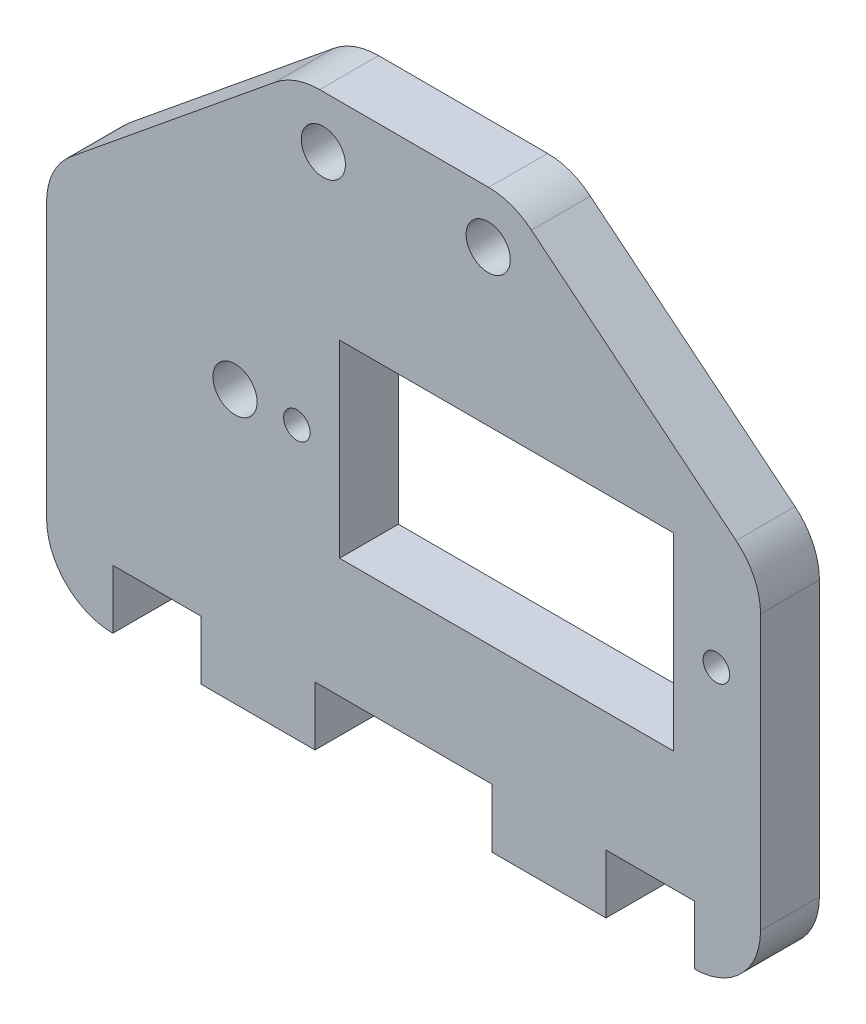
ISO-10303-21;
HEADER;
FILE_DESCRIPTION(('STEP AP214'),'2;1');
FILE_NAME('part.step','',(''),(''),'','','');
FILE_SCHEMA(('AUTOMOTIVE_DESIGN { 1 0 10303 214 1 1 1 1 }'));
ENDSEC;
DATA;
#1=APPLICATION_CONTEXT('core data for automotive mechanical design processes');
#2=APPLICATION_PROTOCOL_DEFINITION('international standard','automotive_design',2000,#1);
#3=PRODUCT_CONTEXT('',#1,'mechanical');
#4=PRODUCT('Part','Part','',(#3));
#5=PRODUCT_RELATED_PRODUCT_CATEGORY('part','',(#4));
#6=PRODUCT_DEFINITION_FORMATION('','',#4);
#7=PRODUCT_DEFINITION_CONTEXT('part definition',#1,'design');
#8=PRODUCT_DEFINITION('design','',#6,#7);
#9=PRODUCT_DEFINITION_SHAPE('','',#8);
#10=(LENGTH_UNIT() NAMED_UNIT(*) SI_UNIT(.MILLI.,.METRE.));
#11=(NAMED_UNIT(*) PLANE_ANGLE_UNIT() SI_UNIT($,.RADIAN.));
#12=(NAMED_UNIT(*) SI_UNIT($,.STERADIAN.) SOLID_ANGLE_UNIT());
#13=UNCERTAINTY_MEASURE_WITH_UNIT(LENGTH_MEASURE(1.E-05),#10,'distance_accuracy_value','');
#14=(GEOMETRIC_REPRESENTATION_CONTEXT(3) GLOBAL_UNCERTAINTY_ASSIGNED_CONTEXT((#13)) GLOBAL_UNIT_ASSIGNED_CONTEXT((#10,
#11,#12)) REPRESENTATION_CONTEXT('',''));
#15=CARTESIAN_POINT('',(0.,0.,0.));
#16=DIRECTION('',(0.,0.,1.));
#17=DIRECTION('',(1.,0.,0.));
#18=AXIS2_PLACEMENT_3D('',#15,#16,#17);
#19=CARTESIAN_POINT('',(48.5000011905378,0.,8.00000018998981));
#20=DIRECTION('',(1.,0.,0.));
#21=DIRECTION('',(0.,1.,0.));
#22=AXIS2_PLACEMENT_3D('',#19,#20,#21);
#23=PLANE('',#22);
#24=DIRECTION('',(0.,-1.,0.));
#25=VECTOR('',#24,1.);
#26=CARTESIAN_POINT('',(48.5000011905378,0.,4.00000018998981));
#27=LINE('',#26,#25);
#28=CARTESIAN_POINT('',(48.5000011905378,23.2964570055421,4.00000018998981));
#29=VERTEX_POINT('',#28);
#30=CARTESIAN_POINT('',(48.5000011905378,4.66041975562339,4.00000018998981));
#31=VERTEX_POINT('',#30);
#32=EDGE_CURVE('E362',#29,#31,#27,.T.);
#33=ORIENTED_EDGE('',*,*,#32,.F.);
#34=DIRECTION('',(0.,0.,-1.));
#35=VECTOR('',#34,1.);
#36=CARTESIAN_POINT('',(48.5000011905378,23.2964570055421,8.00000018998981));
#37=LINE('',#36,#35);
#38=CARTESIAN_POINT('',(48.5000011905378,23.2964570055421,8.00000018998981));
#39=VERTEX_POINT('',#38);
#40=EDGE_CURVE('E11',#39,#29,#37,.T.);
#41=ORIENTED_EDGE('',*,*,#40,.F.);
#42=DIRECTION('',(0.,-1.,0.));
#43=VECTOR('',#42,1.);
#44=CARTESIAN_POINT('',(48.5000011905378,0.,8.00000018998981));
#45=LINE('',#44,#43);
#46=CARTESIAN_POINT('',(48.5000011905378,4.66041975562339,8.00000018998981));
#47=VERTEX_POINT('',#46);
#48=EDGE_CURVE('E439',#39,#47,#45,.T.);
#49=ORIENTED_EDGE('',*,*,#48,.T.);
#50=DIRECTION('',(0.,0.,-1.));
#51=VECTOR('',#50,1.);
#52=CARTESIAN_POINT('',(48.5000011905378,4.66041975562339,8.00000018998981));
#53=LINE('',#52,#51);
#54=EDGE_CURVE('E144',#47,#31,#53,.T.);
#55=ORIENTED_EDGE('',*,*,#54,.T.);
#56=EDGE_LOOP('',(#33,#41,#49,#55));
#57=FACE_BOUND('',#56,.T.);
#58=ADVANCED_FACE('F37',(#57),#23,.T.);
#59=CARTESIAN_POINT('',(43.9999982112701,23.2964570055421,8.00000018998981));
#60=DIRECTION('',(0.,0.,-1.));
#61=DIRECTION('',(-1.,0.,0.));
#62=AXIS2_PLACEMENT_3D('',#59,#60,#61);
#63=CYLINDRICAL_SURFACE('',#62,4.50000297926772);
#64=CARTESIAN_POINT('',(43.9999982112701,23.2964570055421,4.00000018998981));
#65=DIRECTION('',(0.,0.,1.));
#66=DIRECTION('',(1.,0.,0.));
#67=AXIS2_PLACEMENT_3D('',#64,#65,#66);
#68=CIRCLE('',#67,4.50000297926772);
#69=CARTESIAN_POINT('',(46.8419603816456,26.7854794810994,4.00000018998981));
#70=VERTEX_POINT('',#69);
#71=EDGE_CURVE('E359',#29,#70,#68,.T.);
#72=ORIENTED_EDGE('',*,*,#71,.T.);
#73=DIRECTION('',(0.,0.,-1.));
#74=VECTOR('',#73,1.);
#75=CARTESIAN_POINT('',(46.8419603816456,26.7854794810994,8.00000018998981));
#76=LINE('',#75,#74);
#77=CARTESIAN_POINT('',(46.8419603816456,26.7854794810994,8.00000018998981));
#78=VERTEX_POINT('',#77);
#79=EDGE_CURVE('E47',#78,#70,#76,.T.);
#80=ORIENTED_EDGE('',*,*,#79,.F.);
#81=CARTESIAN_POINT('',(43.9999982112701,23.2964570055421,8.00000018998981));
#82=DIRECTION('',(0.,0.,1.));
#83=DIRECTION('',(1.,0.,0.));
#84=AXIS2_PLACEMENT_3D('',#81,#82,#83);
#85=CIRCLE('',#84,4.50000297926772);
#86=EDGE_CURVE('E437',#39,#78,#85,.T.);
#87=ORIENTED_EDGE('',*,*,#86,.F.);
#88=ORIENTED_EDGE('',*,*,#40,.T.);
#89=EDGE_LOOP('',(#72,#80,#87,#88));
#90=FACE_BOUND('',#89,.T.);
#91=ADVANCED_FACE('F491',(#90),#63,.T.);
#92=CARTESIAN_POINT('',(31.7689598199406,39.0485193422076,8.00000018998981));
#93=DIRECTION('',(0.631095510819001,0.775705134844487,0.));
#94=DIRECTION('',(-0.775705134844487,0.631095510819001,0.));
#95=AXIS2_PLACEMENT_3D('',#92,#93,#94);
#96=PLANE('',#95);
#97=DIRECTION('',(0.775705134844487,-0.631095510819001,0.));
#98=VECTOR('',#97,1.);
#99=CARTESIAN_POINT('',(31.7689598199406,39.0485193422076,4.00000018998981));
#100=LINE('',#99,#98);
#101=CARTESIAN_POINT('',(32.9388057625467,38.0967601110707,4.00000018998981));
#102=VERTEX_POINT('',#101);
#103=EDGE_CURVE('E356',#102,#70,#100,.T.);
#104=ORIENTED_EDGE('',*,*,#103,.F.);
#105=DIRECTION('',(0.,0.,-1.));
#106=VECTOR('',#105,1.);
#107=CARTESIAN_POINT('',(32.9388057625467,38.0967601110707,8.00000018998981));
#108=LINE('',#107,#106);
#109=CARTESIAN_POINT('',(32.9388057625467,38.0967601110707,8.00000018998981));
#110=VERTEX_POINT('',#109);
#111=EDGE_CURVE('E288',#110,#102,#108,.T.);
#112=ORIENTED_EDGE('',*,*,#111,.F.);
#113=DIRECTION('',(0.775705134844487,-0.631095510819001,0.));
#114=VECTOR('',#113,1.);
#115=CARTESIAN_POINT('',(31.7689598199406,39.0485193422076,8.00000018998981));
#116=LINE('',#115,#114);
#117=EDGE_CURVE('E434',#110,#78,#116,.T.);
#118=ORIENTED_EDGE('',*,*,#117,.T.);
#119=ORIENTED_EDGE('',*,*,#79,.T.);
#120=EDGE_LOOP('',(#104,#112,#118,#119));
#121=FACE_BOUND('',#120,.T.);
#122=ADVANCED_FACE('F498',(#121),#96,.T.);
#123=CARTESIAN_POINT('',(30.0333677160914,34.6604309180906,8.00000018998981));
#124=DIRECTION('',(0.,0.,-1.));
#125=DIRECTION('',(-1.,0.,0.));
#126=AXIS2_PLACEMENT_3D('',#123,#124,#125);
#127=CYLINDRICAL_SURFACE('',#126,4.49999206269489);
#128=CARTESIAN_POINT('',(30.0333677160914,34.6604309180906,4.00000018998981));
#129=DIRECTION('',(0.,0.,1.));
#130=DIRECTION('',(1.,0.,0.));
#131=AXIS2_PLACEMENT_3D('',#128,#129,#130);
#132=CIRCLE('',#131,4.49999206269489);
#133=CARTESIAN_POINT('',(30.0333677160914,39.1604229807855,4.00000018998981));
#134=VERTEX_POINT('',#133);
#135=EDGE_CURVE('E353',#102,#134,#132,.T.);
#136=ORIENTED_EDGE('',*,*,#135,.T.);
#137=DIRECTION('',(0.,0.,-1.));
#138=VECTOR('',#137,1.);
#139=CARTESIAN_POINT('',(30.0333677160914,39.1604229807855,8.00000018998981));
#140=LINE('',#139,#138);
#141=CARTESIAN_POINT('',(30.0333677160914,39.1604229807855,8.00000018998981));
#142=VERTEX_POINT('',#141);
#143=EDGE_CURVE('E286',#142,#134,#140,.T.);
#144=ORIENTED_EDGE('',*,*,#143,.F.);
#145=CARTESIAN_POINT('',(30.0333677160914,34.6604309180906,8.00000018998981));
#146=DIRECTION('',(0.,0.,1.));
#147=DIRECTION('',(1.,0.,0.));
#148=AXIS2_PLACEMENT_3D('',#145,#146,#147);
#149=CIRCLE('',#148,4.49999206269489);
#150=EDGE_CURVE('E432',#110,#142,#149,.T.);
#151=ORIENTED_EDGE('',*,*,#150,.F.);
#152=ORIENTED_EDGE('',*,*,#111,.T.);
#153=EDGE_LOOP('',(#136,#144,#151,#152));
#154=FACE_BOUND('',#153,.T.);
#155=ADVANCED_FACE('F501',(#154),#127,.T.);
#156=CARTESIAN_POINT('',(0.0434300907564626,39.1936545262637,8.00000018998981));
#157=DIRECTION('',(0.00110808916949251,0.999999386069008,0.));
#158=DIRECTION('',(-0.999999386069008,0.00110808916949251,0.));
#159=AXIS2_PLACEMENT_3D('',#156,#157,#158);
#160=PLANE('',#159);
#161=DIRECTION('',(0.999999386069008,-0.00110808916949251,0.));
#162=VECTOR('',#161,1.);
#163=CARTESIAN_POINT('',(0.0434300907564626,39.1936545262637,4.00000018998981));
#164=LINE('',#163,#162);
#165=CARTESIAN_POINT('',(18.5513384248133,39.173146100898,4.00000018998981));
#166=VERTEX_POINT('',#165);
#167=EDGE_CURVE('E350',#166,#134,#164,.T.);
#168=ORIENTED_EDGE('',*,*,#167,.F.);
#169=DIRECTION('',(0.,0.,-1.));
#170=VECTOR('',#169,1.);
#171=CARTESIAN_POINT('',(18.5513384248133,39.173146100898,8.00000018998981));
#172=LINE('',#171,#170);
#173=CARTESIAN_POINT('',(18.5513384248133,39.173146100898,8.00000018998981));
#174=VERTEX_POINT('',#173);
#175=EDGE_CURVE('E284',#174,#166,#172,.T.);
#176=ORIENTED_EDGE('',*,*,#175,.F.);
#177=DIRECTION('',(0.999999386069008,-0.00110808916949251,0.));
#178=VECTOR('',#177,1.);
#179=CARTESIAN_POINT('',(0.0434300907564626,39.1936545262637,8.00000018998981));
#180=LINE('',#179,#178);
#181=EDGE_CURVE('E429',#174,#142,#180,.T.);
#182=ORIENTED_EDGE('',*,*,#181,.T.);
#183=ORIENTED_EDGE('',*,*,#143,.T.);
#184=EDGE_LOOP('',(#168,#176,#182,#183));
#185=FACE_BOUND('',#184,.T.);
#186=ADVANCED_FACE('F504',(#185),#160,.T.);
#187=CARTESIAN_POINT('',(18.5513384248133,34.3894231612708,8.00000018998981));
#188=DIRECTION('',(0.,0.,-1.));
#189=DIRECTION('',(-1.,0.,0.));
#190=AXIS2_PLACEMENT_3D('',#187,#188,#189);
#191=CYLINDRICAL_SURFACE('',#190,4.78372147118932);
#192=CARTESIAN_POINT('',(18.5513384248133,34.3894231612708,4.00000018998981));
#193=DIRECTION('',(0.,0.,1.));
#194=DIRECTION('',(1.,0.,0.));
#195=AXIS2_PLACEMENT_3D('',#192,#193,#194);
#196=CIRCLE('',#195,4.78372147118932);
#197=CARTESIAN_POINT('',(15.5280312710044,38.0966618933791,4.00000018998981));
#198=VERTEX_POINT('',#197);
#199=EDGE_CURVE('E347',#166,#198,#196,.T.);
#200=ORIENTED_EDGE('',*,*,#199,.T.);
#201=DIRECTION('',(0.,0.,-1.));
#202=VECTOR('',#201,1.);
#203=CARTESIAN_POINT('',(15.5280312710044,38.0966618933791,8.00000018998981));
#204=LINE('',#203,#202);
#205=CARTESIAN_POINT('',(15.5280312710044,38.0966618933791,8.00000018998981));
#206=VERTEX_POINT('',#205);
#207=EDGE_CURVE('E282',#206,#198,#204,.T.);
#208=ORIENTED_EDGE('',*,*,#207,.F.);
#209=CARTESIAN_POINT('',(18.5513384248133,34.3894231612708,8.00000018998981));
#210=DIRECTION('',(0.,0.,1.));
#211=DIRECTION('',(1.,0.,0.));
#212=AXIS2_PLACEMENT_3D('',#209,#210,#211);
#213=CIRCLE('',#212,4.78372147118932);
#214=EDGE_CURVE('E427',#174,#206,#213,.T.);
#215=ORIENTED_EDGE('',*,*,#214,.F.);
#216=ORIENTED_EDGE('',*,*,#175,.T.);
#217=EDGE_LOOP('',(#200,#208,#215,#216));
#218=FACE_BOUND('',#217,.T.);
#219=ADVANCED_FACE('F509',(#218),#191,.T.);
#220=CARTESIAN_POINT('',(-12.4567271646995,15.2746840036084,8.00000018998981));
#221=DIRECTION('',(-0.631998799254137,0.77496936567927,0.));
#222=DIRECTION('',(-0.77496936567927,-0.631998799254137,0.));
#223=AXIS2_PLACEMENT_3D('',#220,#221,#222);
#224=PLANE('',#223);
#225=DIRECTION('',(0.77496936567927,0.631998799254137,0.));
#226=VECTOR('',#225,1.);
#227=CARTESIAN_POINT('',(-12.4567271646995,15.2746840036084,4.00000018998981));
#228=LINE('',#227,#226);
#229=CARTESIAN_POINT('',(1.65600894175858,26.783825743236,4.00000018998981));
#230=VERTEX_POINT('',#229);
#231=EDGE_CURVE('E344',#230,#198,#228,.T.);
#232=ORIENTED_EDGE('',*,*,#231,.F.);
#233=DIRECTION('',(0.,0.,-1.));
#234=VECTOR('',#233,1.);
#235=CARTESIAN_POINT('',(1.65600894175858,26.783825743236,8.00000018998981));
#236=LINE('',#235,#234);
#237=CARTESIAN_POINT('',(1.65600894175858,26.783825743236,8.00000018998981));
#238=VERTEX_POINT('',#237);
#239=EDGE_CURVE('E280',#238,#230,#236,.T.);
#240=ORIENTED_EDGE('',*,*,#239,.F.);
#241=DIRECTION('',(0.77496936567927,0.631998799254137,0.));
#242=VECTOR('',#241,1.);
#243=CARTESIAN_POINT('',(-12.4567271646995,15.2746840036084,8.00000018998981));
#244=LINE('',#243,#242);
#245=EDGE_CURVE('E424',#238,#206,#244,.T.);
#246=ORIENTED_EDGE('',*,*,#245,.T.);
#247=ORIENTED_EDGE('',*,*,#207,.T.);
#248=EDGE_LOOP('',(#232,#240,#246,#247));
#249=FACE_BOUND('',#248,.T.);
#250=ADVANCED_FACE('F513',(#249),#224,.T.);
#251=CARTESIAN_POINT('',(4.50000892150144,23.296456996817,8.00000018998981));
#252=DIRECTION('',(0.,0.,-1.));
#253=DIRECTION('',(-1.,0.,0.));
#254=AXIS2_PLACEMENT_3D('',#251,#252,#253);
#255=CYLINDRICAL_SURFACE('',#254,4.50000830474149);
#256=CARTESIAN_POINT('',(4.50000892150144,23.296456996817,4.00000018998981));
#257=DIRECTION('',(0.,0.,1.));
#258=DIRECTION('',(1.,0.,0.));
#259=AXIS2_PLACEMENT_3D('',#256,#257,#258);
#260=CIRCLE('',#259,4.50000830474149);
#261=CARTESIAN_POINT('',(8.295967237823E-07,23.296456996817,4.00000018998981));
#262=VERTEX_POINT('',#261);
#263=EDGE_CURVE('E341',#230,#262,#260,.T.);
#264=ORIENTED_EDGE('',*,*,#263,.T.);
#265=DIRECTION('',(0.,0.,-1.));
#266=VECTOR('',#265,1.);
#267=CARTESIAN_POINT('',(8.295967237823E-07,23.296456996817,8.00000018998981));
#268=LINE('',#267,#266);
#269=CARTESIAN_POINT('',(8.295967237823E-07,23.296456996817,8.00000018998981));
#270=VERTEX_POINT('',#269);
#271=EDGE_CURVE('E277',#270,#262,#268,.T.);
#272=ORIENTED_EDGE('',*,*,#271,.F.);
#273=CARTESIAN_POINT('',(4.50000892150144,23.296456996817,8.00000018998981));
#274=DIRECTION('',(0.,0.,1.));
#275=DIRECTION('',(1.,0.,0.));
#276=AXIS2_PLACEMENT_3D('',#273,#274,#275);
#277=CIRCLE('',#276,4.50000830474149);
#278=EDGE_CURVE('E421',#238,#270,#277,.T.);
#279=ORIENTED_EDGE('',*,*,#278,.F.);
#280=ORIENTED_EDGE('',*,*,#239,.T.);
#281=EDGE_LOOP('',(#264,#272,#279,#280));
#282=FACE_BOUND('',#281,.T.);
#283=ADVANCED_FACE('F518',(#282),#255,.T.);
#284=CARTESIAN_POINT('',(8.29596727035104E-07,0.,8.00000018998981));
#285=DIRECTION('',(1.,0.,0.));
#286=DIRECTION('',(0.,1.,0.));
#287=AXIS2_PLACEMENT_3D('',#284,#285,#286);
#288=PLANE('',#287);
#289=DIRECTION('',(0.,-1.,0.));
#290=VECTOR('',#289,1.);
#291=CARTESIAN_POINT('',(8.29596727035104E-07,0.,4.00000018998981));
#292=LINE('',#291,#290);
#293=CARTESIAN_POINT('',(8.29596726384385E-07,4.66042119979394,4.00000018998981));
#294=VERTEX_POINT('',#293);
#295=EDGE_CURVE('E338',#262,#294,#292,.T.);
#296=ORIENTED_EDGE('',*,*,#295,.T.);
#297=DIRECTION('',(0.,0.,-1.));
#298=VECTOR('',#297,1.);
#299=CARTESIAN_POINT('',(8.29596726384385E-07,4.66042119979394,8.00000018998981));
#300=LINE('',#299,#298);
#301=CARTESIAN_POINT('',(8.29596726384385E-07,4.66042119979394,8.00000018998981));
#302=VERTEX_POINT('',#301);
#303=EDGE_CURVE('E274',#302,#294,#300,.T.);
#304=ORIENTED_EDGE('',*,*,#303,.F.);
#305=DIRECTION('',(0.,-1.,0.));
#306=VECTOR('',#305,1.);
#307=CARTESIAN_POINT('',(8.29596727035104E-07,0.,8.00000018998981));
#308=LINE('',#307,#306);
#309=EDGE_CURVE('E418',#270,#302,#308,.T.);
#310=ORIENTED_EDGE('',*,*,#309,.F.);
#311=ORIENTED_EDGE('',*,*,#271,.T.);
#312=EDGE_LOOP('',(#296,#304,#310,#311));
#313=FACE_BOUND('',#312,.T.);
#314=ADVANCED_FACE('F522',(#313),#288,.F.);
#315=CARTESIAN_POINT('',(4.50000075548674,4.66042119979394,8.00000018998981));
#316=DIRECTION('',(0.,0.,-1.));
#317=DIRECTION('',(-1.,0.,0.));
#318=AXIS2_PLACEMENT_3D('',#315,#316,#317);
#319=CYLINDRICAL_SURFACE('',#318,4.49999992589002);
#320=CARTESIAN_POINT('',(4.50000075548674,4.66042119979394,4.00000018998981));
#321=DIRECTION('',(0.,0.,1.));
#322=DIRECTION('',(1.,0.,0.));
#323=AXIS2_PLACEMENT_3D('',#320,#321,#322);
#324=CIRCLE('',#323,4.49999992589002);
#325=CARTESIAN_POINT('',(4.50000073760748,0.160421273903922,4.00000018998981));
#326=VERTEX_POINT('',#325);
#327=EDGE_CURVE('E335',#294,#326,#324,.T.);
#328=ORIENTED_EDGE('',*,*,#327,.T.);
#329=DIRECTION('',(0.,0.,-1.));
#330=VECTOR('',#329,1.);
#331=CARTESIAN_POINT('',(4.50000073760748,0.160421273903922,8.00000018998981));
#332=LINE('',#331,#330);
#333=CARTESIAN_POINT('',(4.50000073760748,0.160421273903922,8.00000018998981));
#334=VERTEX_POINT('',#333);
#335=EDGE_CURVE('E271',#334,#326,#332,.T.);
#336=ORIENTED_EDGE('',*,*,#335,.F.);
#337=CARTESIAN_POINT('',(4.50000075548674,4.66042119979394,8.00000018998981));
#338=DIRECTION('',(0.,0.,1.));
#339=DIRECTION('',(1.,0.,0.));
#340=AXIS2_PLACEMENT_3D('',#337,#338,#339);
#341=CIRCLE('',#340,4.49999992589002);
#342=EDGE_CURVE('E415',#302,#334,#341,.T.);
#343=ORIENTED_EDGE('',*,*,#342,.F.);
#344=ORIENTED_EDGE('',*,*,#303,.T.);
#345=EDGE_LOOP('',(#328,#336,#343,#344));
#346=FACE_BOUND('',#345,.T.);
#347=ADVANCED_FACE('F524',(#346),#319,.T.);
#348=CARTESIAN_POINT('',(4.50000073760748,0.,8.00000018998981));
#349=DIRECTION('',(-1.,0.,0.));
#350=DIRECTION('',(0.,0.,1.));
#351=AXIS2_PLACEMENT_3D('',#348,#349,#350);
#352=PLANE('',#351);
#353=DIRECTION('',(0.,1.,0.));
#354=VECTOR('',#353,1.);
#355=CARTESIAN_POINT('',(4.50000073760748,0.,4.00000018998981));
#356=LINE('',#355,#354);
#357=CARTESIAN_POINT('',(4.50000073760748,4.1604214347899,4.00000018998981));
#358=VERTEX_POINT('',#357);
#359=EDGE_CURVE('E332',#326,#358,#356,.T.);
#360=ORIENTED_EDGE('',*,*,#359,.T.);
#361=DIRECTION('',(0.,0.,-1.));
#362=VECTOR('',#361,1.);
#363=CARTESIAN_POINT('',(4.50000073760748,4.1604214347899,8.00000018998981));
#364=LINE('',#363,#362);
#365=CARTESIAN_POINT('',(4.50000073760748,4.1604214347899,8.00000018998981));
#366=VERTEX_POINT('',#365);
#367=EDGE_CURVE('E268',#366,#358,#364,.T.);
#368=ORIENTED_EDGE('',*,*,#367,.F.);
#369=DIRECTION('',(0.,1.,0.));
#370=VECTOR('',#369,1.);
#371=CARTESIAN_POINT('',(4.50000073760748,0.,8.00000018998981));
#372=LINE('',#371,#370);
#373=EDGE_CURVE('E412',#334,#366,#372,.T.);
#374=ORIENTED_EDGE('',*,*,#373,.F.);
#375=ORIENTED_EDGE('',*,*,#335,.T.);
#376=EDGE_LOOP('',(#360,#368,#374,#375));
#377=FACE_BOUND('',#376,.T.);
#378=ADVANCED_FACE('F526',(#377),#352,.F.);
#379=CARTESIAN_POINT('',(0.,4.1604214347899,8.00000018998981));
#380=DIRECTION('',(0.,1.,0.));
#381=DIRECTION('',(0.,0.,1.));
#382=AXIS2_PLACEMENT_3D('',#379,#380,#381);
#383=PLANE('',#382);
#384=DIRECTION('',(1.,0.,0.));
#385=VECTOR('',#384,1.);
#386=CARTESIAN_POINT('',(0.,4.1604214347899,4.00000018998981));
#387=LINE('',#386,#385);
#388=CARTESIAN_POINT('',(10.5000007897615,4.1604214347899,4.00000018998981));
#389=VERTEX_POINT('',#388);
#390=EDGE_CURVE('E329',#358,#389,#387,.T.);
#391=ORIENTED_EDGE('',*,*,#390,.T.);
#392=DIRECTION('',(0.,0.,-1.));
#393=VECTOR('',#392,1.);
#394=CARTESIAN_POINT('',(10.5000007897615,4.1604214347899,8.00000018998981));
#395=LINE('',#394,#393);
#396=CARTESIAN_POINT('',(10.5000007897615,4.1604214347899,8.00000018998981));
#397=VERTEX_POINT('',#396);
#398=EDGE_CURVE('E265',#397,#389,#395,.T.);
#399=ORIENTED_EDGE('',*,*,#398,.F.);
#400=DIRECTION('',(1.,0.,0.));
#401=VECTOR('',#400,1.);
#402=CARTESIAN_POINT('',(0.,4.1604214347899,8.00000018998981));
#403=LINE('',#402,#401);
#404=EDGE_CURVE('E409',#366,#397,#403,.T.);
#405=ORIENTED_EDGE('',*,*,#404,.F.);
#406=ORIENTED_EDGE('',*,*,#367,.T.);
#407=EDGE_LOOP('',(#391,#399,#405,#406));
#408=FACE_BOUND('',#407,.T.);
#409=ADVANCED_FACE('F531',(#408),#383,.F.);
#410=CARTESIAN_POINT('',(10.5000007897615,0.,8.00000018998981));
#411=DIRECTION('',(1.,0.,0.));
#412=DIRECTION('',(0.,0.,-1.));
#413=AXIS2_PLACEMENT_3D('',#410,#411,#412);
#414=PLANE('',#413);
#415=DIRECTION('',(0.,-1.,0.));
#416=VECTOR('',#415,1.);
#417=CARTESIAN_POINT('',(10.5000007897615,0.,4.00000018998981));
#418=LINE('',#417,#416);
#419=CARTESIAN_POINT('',(10.5000007897615,0.160421273903921,4.00000018998981));
#420=VERTEX_POINT('',#419);
#421=EDGE_CURVE('E326',#389,#420,#418,.T.);
#422=ORIENTED_EDGE('',*,*,#421,.T.);
#423=DIRECTION('',(0.,0.,-1.));
#424=VECTOR('',#423,1.);
#425=CARTESIAN_POINT('',(10.5000007897615,0.160421273903921,8.00000018998981));
#426=LINE('',#425,#424);
#427=CARTESIAN_POINT('',(10.5000007897615,0.160421273903921,8.00000018998981));
#428=VERTEX_POINT('',#427);
#429=EDGE_CURVE('E262',#428,#420,#426,.T.);
#430=ORIENTED_EDGE('',*,*,#429,.F.);
#431=DIRECTION('',(0.,-1.,0.));
#432=VECTOR('',#431,1.);
#433=CARTESIAN_POINT('',(10.5000007897615,0.,8.00000018998981));
#434=LINE('',#433,#432);
#435=EDGE_CURVE('E406',#397,#428,#434,.T.);
#436=ORIENTED_EDGE('',*,*,#435,.F.);
#437=ORIENTED_EDGE('',*,*,#398,.T.);
#438=EDGE_LOOP('',(#422,#430,#436,#437));
#439=FACE_BOUND('',#438,.T.);
#440=ADVANCED_FACE('F533',(#439),#414,.F.);
#441=CARTESIAN_POINT('',(0.,0.160421273903921,8.00000018998981));
#442=DIRECTION('',(0.,1.,0.));
#443=DIRECTION('',(0.,0.,1.));
#444=AXIS2_PLACEMENT_3D('',#441,#442,#443);
#445=PLANE('',#444);
#446=DIRECTION('',(1.,0.,0.));
#447=VECTOR('',#446,1.);
#448=CARTESIAN_POINT('',(0.,0.160421273903921,4.00000018998981));
#449=LINE('',#448,#447);
#450=CARTESIAN_POINT('',(18.234828028689,0.160421273903921,4.00000018998981));
#451=VERTEX_POINT('',#450);
#452=EDGE_CURVE('E323',#420,#451,#449,.T.);
#453=ORIENTED_EDGE('',*,*,#452,.T.);
#454=DIRECTION('',(0.,0.,-1.));
#455=VECTOR('',#454,1.);
#456=CARTESIAN_POINT('',(18.234828028689,0.160421273903921,8.00000018998981));
#457=LINE('',#456,#455);
#458=CARTESIAN_POINT('',(18.234828028689,0.160421273903921,8.00000018998981));
#459=VERTEX_POINT('',#458);
#460=EDGE_CURVE('E259',#459,#451,#457,.T.);
#461=ORIENTED_EDGE('',*,*,#460,.F.);
#462=DIRECTION('',(1.,0.,0.));
#463=VECTOR('',#462,1.);
#464=CARTESIAN_POINT('',(0.,0.160421273903921,8.00000018998981));
#465=LINE('',#464,#463);
#466=EDGE_CURVE('E403',#428,#459,#465,.T.);
#467=ORIENTED_EDGE('',*,*,#466,.F.);
#468=ORIENTED_EDGE('',*,*,#429,.T.);
#469=EDGE_LOOP('',(#453,#461,#467,#468));
#470=FACE_BOUND('',#469,.T.);
#471=ADVANCED_FACE('F535',(#470),#445,.F.);
#472=CARTESIAN_POINT('',(18.2339571047138,-0.069168533903372,8.00000018998981));
#473=DIRECTION('',(-0.999992805168943,0.00379336398842218,0.));
#474=DIRECTION('',(-0.00379336398842218,-0.999992805168943,0.));
#475=AXIS2_PLACEMENT_3D('',#472,#473,#474);
#476=PLANE('',#475);
#477=DIRECTION('',(0.00379336398842218,0.999992805168943,0.));
#478=VECTOR('',#477,1.);
#479=CARTESIAN_POINT('',(18.2339571047138,-0.069168533903372,4.00000018998981));
#480=LINE('',#479,#478);
#481=CARTESIAN_POINT('',(18.2500015944242,4.1604214347899,4.00000018998981));
#482=VERTEX_POINT('',#481);
#483=EDGE_CURVE('E320',#451,#482,#480,.T.);
#484=ORIENTED_EDGE('',*,*,#483,.T.);
#485=DIRECTION('',(0.,0.,-1.));
#486=VECTOR('',#485,1.);
#487=CARTESIAN_POINT('',(18.2500015944242,4.1604214347899,8.00000018998981));
#488=LINE('',#487,#486);
#489=CARTESIAN_POINT('',(18.2500015944242,4.1604214347899,8.00000018998981));
#490=VERTEX_POINT('',#489);
#491=EDGE_CURVE('E256',#490,#482,#488,.T.);
#492=ORIENTED_EDGE('',*,*,#491,.F.);
#493=DIRECTION('',(0.00379336398842218,0.999992805168943,0.));
#494=VECTOR('',#493,1.);
#495=CARTESIAN_POINT('',(18.2339571047138,-0.069168533903372,8.00000018998981));
#496=LINE('',#495,#494);
#497=EDGE_CURVE('E400',#459,#490,#496,.T.);
#498=ORIENTED_EDGE('',*,*,#497,.F.);
#499=ORIENTED_EDGE('',*,*,#460,.T.);
#500=EDGE_LOOP('',(#484,#492,#498,#499));
#501=FACE_BOUND('',#500,.T.);
#502=ADVANCED_FACE('F540',(#501),#476,.F.);
#503=CARTESIAN_POINT('',(0.,4.1604214347899,8.00000018998981));
#504=DIRECTION('',(0.,1.,0.));
#505=DIRECTION('',(0.,0.,1.));
#506=AXIS2_PLACEMENT_3D('',#503,#504,#505);
#507=PLANE('',#506);
#508=DIRECTION('',(1.,0.,0.));
#509=VECTOR('',#508,1.);
#510=CARTESIAN_POINT('',(0.,4.1604214347899,4.00000018998981));
#511=LINE('',#510,#509);
#512=CARTESIAN_POINT('',(30.2500016987324,4.1604214347899,4.00000018998981));
#513=VERTEX_POINT('',#512);
#514=EDGE_CURVE('E317',#482,#513,#511,.T.);
#515=ORIENTED_EDGE('',*,*,#514,.T.);
#516=DIRECTION('',(0.,0.,-1.));
#517=VECTOR('',#516,1.);
#518=CARTESIAN_POINT('',(30.2500016987324,4.1604214347899,8.00000018998981));
#519=LINE('',#518,#517);
#520=CARTESIAN_POINT('',(30.2500016987324,4.1604214347899,8.00000018998981));
#521=VERTEX_POINT('',#520);
#522=EDGE_CURVE('E253',#521,#513,#519,.T.);
#523=ORIENTED_EDGE('',*,*,#522,.F.);
#524=DIRECTION('',(1.,0.,0.));
#525=VECTOR('',#524,1.);
#526=CARTESIAN_POINT('',(0.,4.1604214347899,8.00000018998981));
#527=LINE('',#526,#525);
#528=EDGE_CURVE('E397',#490,#521,#527,.T.);
#529=ORIENTED_EDGE('',*,*,#528,.F.);
#530=ORIENTED_EDGE('',*,*,#491,.T.);
#531=EDGE_LOOP('',(#515,#523,#529,#530));
#532=FACE_BOUND('',#531,.T.);
#533=ADVANCED_FACE('F542',(#532),#507,.F.);
#534=CARTESIAN_POINT('',(30.2500016987324,0.,8.00000018998981));
#535=DIRECTION('',(1.,0.,0.));
#536=DIRECTION('',(0.,0.,-1.));
#537=AXIS2_PLACEMENT_3D('',#534,#535,#536);
#538=PLANE('',#537);
#539=DIRECTION('',(0.,-1.,0.));
#540=VECTOR('',#539,1.);
#541=CARTESIAN_POINT('',(30.2500016987324,0.,4.00000018998981));
#542=LINE('',#541,#540);
#543=CARTESIAN_POINT('',(30.2500016987324,0.160421273903921,4.00000018998981));
#544=VERTEX_POINT('',#543);
#545=EDGE_CURVE('E314',#513,#544,#542,.T.);
#546=ORIENTED_EDGE('',*,*,#545,.T.);
#547=DIRECTION('',(0.,0.,-1.));
#548=VECTOR('',#547,1.);
#549=CARTESIAN_POINT('',(30.2500016987324,0.160421273903921,8.00000018998981));
#550=LINE('',#549,#548);
#551=CARTESIAN_POINT('',(30.2500016987324,0.160421273903921,8.00000018998981));
#552=VERTEX_POINT('',#551);
#553=EDGE_CURVE('E250',#552,#544,#550,.T.);
#554=ORIENTED_EDGE('',*,*,#553,.F.);
#555=DIRECTION('',(0.,-1.,0.));
#556=VECTOR('',#555,1.);
#557=CARTESIAN_POINT('',(30.2500016987324,0.,8.00000018998981));
#558=LINE('',#557,#556);
#559=EDGE_CURVE('E394',#521,#552,#558,.T.);
#560=ORIENTED_EDGE('',*,*,#559,.F.);
#561=ORIENTED_EDGE('',*,*,#522,.T.);
#562=EDGE_LOOP('',(#546,#554,#560,#561));
#563=FACE_BOUND('',#562,.T.);
#564=ADVANCED_FACE('F544',(#563),#538,.F.);
#565=CARTESIAN_POINT('',(0.,0.160421273903921,8.00000018998981));
#566=DIRECTION('',(0.,1.,0.));
#567=DIRECTION('',(0.,0.,1.));
#568=AXIS2_PLACEMENT_3D('',#565,#566,#567);
#569=PLANE('',#568);
#570=DIRECTION('',(1.,0.,0.));
#571=VECTOR('',#570,1.);
#572=CARTESIAN_POINT('',(0.,0.160421273903921,4.00000018998981));
#573=LINE('',#572,#571);
#574=CARTESIAN_POINT('',(38.0000025033951,0.160421273903921,4.00000018998981));
#575=VERTEX_POINT('',#574);
#576=EDGE_CURVE('E311',#544,#575,#573,.T.);
#577=ORIENTED_EDGE('',*,*,#576,.T.);
#578=DIRECTION('',(0.,0.,-1.));
#579=VECTOR('',#578,1.);
#580=CARTESIAN_POINT('',(38.0000025033951,0.160421273903921,8.00000018998981));
#581=LINE('',#580,#579);
#582=CARTESIAN_POINT('',(38.0000025033951,0.160421273903921,8.00000018998981));
#583=VERTEX_POINT('',#582);
#584=EDGE_CURVE('E243',#583,#575,#581,.T.);
#585=ORIENTED_EDGE('',*,*,#584,.F.);
#586=DIRECTION('',(1.,0.,0.));
#587=VECTOR('',#586,1.);
#588=CARTESIAN_POINT('',(0.,0.160421273903921,8.00000018998981));
#589=LINE('',#588,#587);
#590=EDGE_CURVE('E392',#552,#583,#589,.T.);
#591=ORIENTED_EDGE('',*,*,#590,.F.);
#592=ORIENTED_EDGE('',*,*,#553,.T.);
#593=EDGE_LOOP('',(#577,#585,#591,#592));
#594=FACE_BOUND('',#593,.T.);
#595=ADVANCED_FACE('F548',(#594),#569,.F.);
#596=CARTESIAN_POINT('',(38.0000025033951,0.,8.00000018998981));
#597=DIRECTION('',(-1.,0.,0.));
#598=DIRECTION('',(0.,0.,1.));
#599=AXIS2_PLACEMENT_3D('',#596,#597,#598);
#600=PLANE('',#599);
#601=DIRECTION('',(0.,1.,0.));
#602=VECTOR('',#601,1.);
#603=CARTESIAN_POINT('',(38.0000025033951,0.,4.00000018998981));
#604=LINE('',#603,#602);
#605=CARTESIAN_POINT('',(38.0000025033951,4.1604214347899,4.00000018998981));
#606=VERTEX_POINT('',#605);
#607=EDGE_CURVE('E308',#575,#606,#604,.T.);
#608=ORIENTED_EDGE('',*,*,#607,.T.);
#609=DIRECTION('',(0.,0.,-1.));
#610=VECTOR('',#609,1.);
#611=CARTESIAN_POINT('',(38.0000025033951,4.1604214347899,8.00000018998981));
#612=LINE('',#611,#610);
#613=CARTESIAN_POINT('',(38.0000025033951,4.1604214347899,8.00000018998981));
#614=VERTEX_POINT('',#613);
#615=EDGE_CURVE('E241',#614,#606,#612,.T.);
#616=ORIENTED_EDGE('',*,*,#615,.F.);
#617=DIRECTION('',(0.,1.,0.));
#618=VECTOR('',#617,1.);
#619=CARTESIAN_POINT('',(38.0000025033951,0.,8.00000018998981));
#620=LINE('',#619,#618);
#621=EDGE_CURVE('E234',#583,#614,#620,.T.);
#622=ORIENTED_EDGE('',*,*,#621,.F.);
#623=ORIENTED_EDGE('',*,*,#584,.T.);
#624=EDGE_LOOP('',(#608,#616,#622,#623));
#625=FACE_BOUND('',#624,.T.);
#626=ADVANCED_FACE('F550',(#625),#600,.F.);
#627=CARTESIAN_POINT('',(0.,4.1604214347899,8.00000018998981));
#628=DIRECTION('',(0.,1.,0.));
#629=DIRECTION('',(0.,0.,1.));
#630=AXIS2_PLACEMENT_3D('',#627,#628,#629);
#631=PLANE('',#630);
#632=DIRECTION('',(1.,0.,0.));
#633=VECTOR('',#632,1.);
#634=CARTESIAN_POINT('',(0.,4.1604214347899,4.00000018998981));
#635=LINE('',#634,#633);
#636=CARTESIAN_POINT('',(43.9999997615814,4.1604214347899,4.00000018998981));
#637=VERTEX_POINT('',#636);
#638=EDGE_CURVE('E240',#606,#637,#635,.T.);
#639=ORIENTED_EDGE('',*,*,#638,.T.);
#640=DIRECTION('',(0.,0.,-1.));
#641=VECTOR('',#640,1.);
#642=CARTESIAN_POINT('',(43.9999997615814,4.1604214347899,8.00000018998981));
#643=LINE('',#642,#641);
#644=CARTESIAN_POINT('',(43.9999997615814,4.1604214347899,8.00000018998981));
#645=VERTEX_POINT('',#644);
#646=EDGE_CURVE('E226',#645,#637,#643,.T.);
#647=ORIENTED_EDGE('',*,*,#646,.F.);
#648=DIRECTION('',(1.,0.,0.));
#649=VECTOR('',#648,1.);
#650=CARTESIAN_POINT('',(0.,4.1604214347899,8.00000018998981));
#651=LINE('',#650,#649);
#652=EDGE_CURVE('E229',#614,#645,#651,.T.);
#653=ORIENTED_EDGE('',*,*,#652,.F.);
#654=ORIENTED_EDGE('',*,*,#615,.T.);
#655=EDGE_LOOP('',(#639,#647,#653,#654));
#656=FACE_BOUND('',#655,.T.);
#657=ADVANCED_FACE('F239',(#656),#631,.F.);
#658=CARTESIAN_POINT('',(43.9999997615814,0.,8.00000018998981));
#659=DIRECTION('',(1.,0.,0.));
#660=DIRECTION('',(0.,0.,-1.));
#661=AXIS2_PLACEMENT_3D('',#658,#659,#660);
#662=PLANE('',#661);
#663=DIRECTION('',(0.,-1.,0.));
#664=VECTOR('',#663,1.);
#665=CARTESIAN_POINT('',(43.9999997615814,0.,4.00000018998981));
#666=LINE('',#665,#664);
#667=CARTESIAN_POINT('',(43.9999997615814,0.160421273903921,4.00000018998981));
#668=VERTEX_POINT('',#667);
#669=EDGE_CURVE('E305',#637,#668,#666,.T.);
#670=ORIENTED_EDGE('',*,*,#669,.T.);
#671=DIRECTION('',(0.,0.,-1.));
#672=VECTOR('',#671,1.);
#673=CARTESIAN_POINT('',(43.9999997615814,0.160421273903921,8.00000018998981));
#674=LINE('',#673,#672);
#675=CARTESIAN_POINT('',(43.9999997615814,0.160421273903921,8.00000018998981));
#676=VERTEX_POINT('',#675);
#677=EDGE_CURVE('E228',#676,#668,#674,.T.);
#678=ORIENTED_EDGE('',*,*,#677,.F.);
#679=DIRECTION('',(0.,-1.,0.));
#680=VECTOR('',#679,1.);
#681=CARTESIAN_POINT('',(43.9999997615814,0.,8.00000018998981));
#682=LINE('',#681,#680);
#683=EDGE_CURVE('E221',#645,#676,#682,.T.);
#684=ORIENTED_EDGE('',*,*,#683,.F.);
#685=ORIENTED_EDGE('',*,*,#646,.T.);
#686=EDGE_LOOP('',(#670,#678,#684,#685));
#687=FACE_BOUND('',#686,.T.);
#688=ADVANCED_FACE('F224',(#687),#662,.F.);
#689=CARTESIAN_POINT('',(0.,12.2770976079165,8.00000018998981));
#690=DIRECTION('',(0.,1.,0.));
#691=DIRECTION('',(0.,0.,1.));
#692=AXIS2_PLACEMENT_3D('',#689,#690,#691);
#693=PLANE('',#692);
#694=DIRECTION('',(1.,0.,0.));
#695=VECTOR('',#694,1.);
#696=CARTESIAN_POINT('',(0.,12.2770976079165,4.00000018998981));
#697=LINE('',#696,#695);
#698=CARTESIAN_POINT('',(19.9000015854836,12.2770976079165,4.00000018998981));
#699=VERTEX_POINT('',#698);
#700=CARTESIAN_POINT('',(42.6000021398067,12.2770976079165,4.00000018998981));
#701=VERTEX_POINT('',#700);
#702=EDGE_CURVE('E387',#699,#701,#697,.T.);
#703=ORIENTED_EDGE('',*,*,#702,.F.);
#704=DIRECTION('',(0.,0.,-1.));
#705=VECTOR('',#704,1.);
#706=CARTESIAN_POINT('',(19.9000015854836,12.2770976079165,8.00000018998981));
#707=LINE('',#706,#705);
#708=CARTESIAN_POINT('',(19.9000015854836,12.2770976079165,8.00000018998981));
#709=VERTEX_POINT('',#708);
#710=EDGE_CURVE('E41',#709,#699,#707,.T.);
#711=ORIENTED_EDGE('',*,*,#710,.F.);
#712=DIRECTION('',(1.,0.,0.));
#713=VECTOR('',#712,1.);
#714=CARTESIAN_POINT('',(0.,12.2770976079165,8.00000018998981));
#715=LINE('',#714,#713);
#716=CARTESIAN_POINT('',(42.6000021398067,12.2770976079165,8.00000018998981));
#717=VERTEX_POINT('',#716);
#718=EDGE_CURVE('E304',#709,#717,#715,.T.);
#719=ORIENTED_EDGE('',*,*,#718,.T.);
#720=DIRECTION('',(0.,0.,-1.));
#721=VECTOR('',#720,1.);
#722=CARTESIAN_POINT('',(42.6000021398067,12.2770976079165,8.00000018998981));
#723=LINE('',#722,#721);
#724=EDGE_CURVE('E291',#717,#701,#723,.T.);
#725=ORIENTED_EDGE('',*,*,#724,.T.);
#726=EDGE_LOOP('',(#703,#711,#719,#725));
#727=FACE_BOUND('',#726,.T.);
#728=ADVANCED_FACE('F39',(#727),#693,.T.);
#729=CARTESIAN_POINT('',(19.9000015854836,0.,8.00000018998981));
#730=DIRECTION('',(1.,0.,0.));
#731=DIRECTION('',(0.,0.,-1.));
#732=AXIS2_PLACEMENT_3D('',#729,#730,#731);
#733=PLANE('',#732);
#734=DIRECTION('',(0.,-1.,0.));
#735=VECTOR('',#734,1.);
#736=CARTESIAN_POINT('',(19.9000015854836,0.,4.00000018998981));
#737=LINE('',#736,#735);
#738=CARTESIAN_POINT('',(19.9000015854836,25.1104217022657,4.00000018998981));
#739=VERTEX_POINT('',#738);
#740=EDGE_CURVE('E384',#739,#699,#737,.T.);
#741=ORIENTED_EDGE('',*,*,#740,.F.);
#742=DIRECTION('',(0.,0.,-1.));
#743=VECTOR('',#742,1.);
#744=CARTESIAN_POINT('',(19.9000015854836,25.1104217022657,8.00000018998981));
#745=LINE('',#744,#743);
#746=CARTESIAN_POINT('',(19.9000015854836,25.1104217022657,8.00000018998981));
#747=VERTEX_POINT('',#746);
#748=EDGE_CURVE('E295',#747,#739,#745,.T.);
#749=ORIENTED_EDGE('',*,*,#748,.F.);
#750=DIRECTION('',(0.,-1.,0.));
#751=VECTOR('',#750,1.);
#752=CARTESIAN_POINT('',(19.9000015854836,0.,8.00000018998981));
#753=LINE('',#752,#751);
#754=EDGE_CURVE('E460',#747,#709,#753,.T.);
#755=ORIENTED_EDGE('',*,*,#754,.T.);
#756=ORIENTED_EDGE('',*,*,#710,.T.);
#757=EDGE_LOOP('',(#741,#749,#755,#756));
#758=FACE_BOUND('',#757,.T.);
#759=ADVANCED_FACE('F467',(#758),#733,.T.);
#760=CARTESIAN_POINT('',(0.,25.1104217022657,8.00000018998981));
#761=DIRECTION('',(0.,1.,0.));
#762=DIRECTION('',(0.,0.,1.));
#763=AXIS2_PLACEMENT_3D('',#760,#761,#762);
#764=PLANE('',#763);
#765=DIRECTION('',(1.,0.,0.));
#766=VECTOR('',#765,1.);
#767=CARTESIAN_POINT('',(0.,25.1104217022657,4.00000018998981));
#768=LINE('',#767,#766);
#769=CARTESIAN_POINT('',(42.6000021398067,25.1104217022657,4.00000018998981));
#770=VERTEX_POINT('',#769);
#771=EDGE_CURVE('E382',#739,#770,#768,.T.);
#772=ORIENTED_EDGE('',*,*,#771,.T.);
#773=DIRECTION('',(0.,0.,-1.));
#774=VECTOR('',#773,1.);
#775=CARTESIAN_POINT('',(42.6000021398067,25.1104217022657,8.00000018998981));
#776=LINE('',#775,#774);
#777=CARTESIAN_POINT('',(42.6000021398067,25.1104217022657,8.00000018998981));
#778=VERTEX_POINT('',#777);
#779=EDGE_CURVE('E293',#778,#770,#776,.T.);
#780=ORIENTED_EDGE('',*,*,#779,.F.);
#781=DIRECTION('',(1.,0.,0.));
#782=VECTOR('',#781,1.);
#783=CARTESIAN_POINT('',(0.,25.1104217022657,8.00000018998981));
#784=LINE('',#783,#782);
#785=EDGE_CURVE('E458',#747,#778,#784,.T.);
#786=ORIENTED_EDGE('',*,*,#785,.F.);
#787=ORIENTED_EDGE('',*,*,#748,.T.);
#788=EDGE_LOOP('',(#772,#780,#786,#787));
#789=FACE_BOUND('',#788,.T.);
#790=ADVANCED_FACE('F469',(#789),#764,.F.);
#791=CARTESIAN_POINT('',(17.000001427881,18.6604211859787,8.00000018998981));
#792=DIRECTION('',(0.,0.,-1.));
#793=DIRECTION('',(-1.,0.,0.));
#794=AXIS2_PLACEMENT_3D('',#791,#792,#793);
#795=CYLINDRICAL_SURFACE('',#794,0.899999508129575);
#796=CARTESIAN_POINT('',(17.000001427881,18.6604211859787,8.00000018998981));
#797=DIRECTION('',(0.,0.,1.));
#798=DIRECTION('',(1.,0.,0.));
#799=AXIS2_PLACEMENT_3D('',#796,#797,#798);
#800=CIRCLE('',#799,0.899999508129575);
#801=CARTESIAN_POINT('',(17.9000009360106,18.6604211859787,8.00000018998981));
#802=VERTEX_POINT('',#801);
#803=EDGE_CURVE('E441',#802,#802,#800,.T.);
#804=ORIENTED_EDGE('',*,*,#803,.T.);
#805=EDGE_LOOP('',(#804));
#806=FACE_BOUND('',#805,.T.);
#807=CARTESIAN_POINT('',(17.000001427881,18.6604211859787,4.00000018998981));
#808=DIRECTION('',(0.,0.,1.));
#809=DIRECTION('',(1.,0.,0.));
#810=AXIS2_PLACEMENT_3D('',#807,#808,#809);
#811=CIRCLE('',#810,0.899999508129575);
#812=CARTESIAN_POINT('',(17.9000009360106,18.6604211859787,4.00000018998981));
#813=VERTEX_POINT('',#812);
#814=EDGE_CURVE('E364',#813,#813,#811,.T.);
#815=ORIENTED_EDGE('',*,*,#814,.F.);
#816=EDGE_LOOP('',(#815));
#817=FACE_BOUND('',#816,.T.);
#818=ADVANCED_FACE('F567',(#806,#817),#795,.F.);
#819=CARTESIAN_POINT('',(12.8000009838633,18.6604214308945,8.00000018998981));
#820=DIRECTION('',(0.,0.,-1.));
#821=DIRECTION('',(-1.,0.,0.));
#822=AXIS2_PLACEMENT_3D('',#819,#820,#821);
#823=CYLINDRICAL_SURFACE('',#822,1.49999962339817);
#824=CARTESIAN_POINT('',(12.8000009838633,18.6604214308945,8.00000018998981));
#825=DIRECTION('',(0.,0.,1.));
#826=DIRECTION('',(1.,0.,0.));
#827=AXIS2_PLACEMENT_3D('',#824,#825,#826);
#828=CIRCLE('',#827,1.49999962339817);
#829=CARTESIAN_POINT('',(14.3000006072614,18.6604214308945,8.00000018998981));
#830=VERTEX_POINT('',#829);
#831=EDGE_CURVE('E444',#830,#830,#828,.T.);
#832=ORIENTED_EDGE('',*,*,#831,.T.);
#833=EDGE_LOOP('',(#832));
#834=FACE_BOUND('',#833,.T.);
#835=CARTESIAN_POINT('',(12.8000009838633,18.6604214308945,4.00000018998981));
#836=DIRECTION('',(0.,0.,1.));
#837=DIRECTION('',(1.,0.,0.));
#838=AXIS2_PLACEMENT_3D('',#835,#836,#837);
#839=CIRCLE('',#838,1.49999962339817);
#840=CARTESIAN_POINT('',(14.3000006072614,18.6604214308945,4.00000018998981));
#841=VERTEX_POINT('',#840);
#842=EDGE_CURVE('E367',#841,#841,#839,.T.);
#843=ORIENTED_EDGE('',*,*,#842,.F.);
#844=EDGE_LOOP('',(#843));
#845=FACE_BOUND('',#844,.T.);
#846=ADVANCED_FACE('F570',(#834,#845),#823,.F.);
#847=CARTESIAN_POINT('',(45.5000005236093,18.6604209854872,8.00000018998981));
#848=DIRECTION('',(0.,0.,-1.));
#849=DIRECTION('',(-1.,0.,0.));
#850=AXIS2_PLACEMENT_3D('',#847,#848,#849);
#851=CYLINDRICAL_SURFACE('',#850,0.900000045943771);
#852=CARTESIAN_POINT('',(45.5000005236093,18.6604209854872,8.00000018998981));
#853=DIRECTION('',(0.,0.,1.));
#854=DIRECTION('',(1.,0.,0.));
#855=AXIS2_PLACEMENT_3D('',#852,#853,#854);
#856=CIRCLE('',#855,0.900000045943771);
#857=CARTESIAN_POINT('',(46.400000569553,18.6604209854872,8.00000018998981));
#858=VERTEX_POINT('',#857);
#859=EDGE_CURVE('E447',#858,#858,#856,.T.);
#860=ORIENTED_EDGE('',*,*,#859,.T.);
#861=EDGE_LOOP('',(#860));
#862=FACE_BOUND('',#861,.T.);
#863=CARTESIAN_POINT('',(45.5000005236093,18.6604209854872,4.00000018998981));
#864=DIRECTION('',(0.,0.,1.));
#865=DIRECTION('',(1.,0.,0.));
#866=AXIS2_PLACEMENT_3D('',#863,#864,#865);
#867=CIRCLE('',#866,0.900000045943771);
#868=CARTESIAN_POINT('',(46.400000569553,18.6604209854872,4.00000018998981));
#869=VERTEX_POINT('',#868);
#870=EDGE_CURVE('E370',#869,#869,#867,.T.);
#871=ORIENTED_EDGE('',*,*,#870,.F.);
#872=EDGE_LOOP('',(#871));
#873=FACE_BOUND('',#872,.T.);
#874=ADVANCED_FACE('F574',(#862,#873),#851,.F.);
#875=CARTESIAN_POINT('',(30.0000017666279,35.6304220424569,8.00000018998981));
#876=DIRECTION('',(0.,0.,-1.));
#877=DIRECTION('',(-1.,0.,0.));
#878=AXIS2_PLACEMENT_3D('',#875,#876,#877);
#879=CYLINDRICAL_SURFACE('',#878,1.49999985939195);
#880=CARTESIAN_POINT('',(30.0000017666279,35.6304220424569,8.00000018998981));
#881=DIRECTION('',(0.,0.,1.));
#882=DIRECTION('',(1.,0.,0.));
#883=AXIS2_PLACEMENT_3D('',#880,#881,#882);
#884=CIRCLE('',#883,1.49999985939195);
#885=CARTESIAN_POINT('',(31.5000016260199,35.6304220424569,8.00000018998981));
#886=VERTEX_POINT('',#885);
#887=EDGE_CURVE('E450',#886,#886,#884,.T.);
#888=ORIENTED_EDGE('',*,*,#887,.T.);
#889=EDGE_LOOP('',(#888));
#890=FACE_BOUND('',#889,.T.);
#891=CARTESIAN_POINT('',(30.0000017666279,35.6304220424569,4.00000018998981));
#892=DIRECTION('',(0.,0.,1.));
#893=DIRECTION('',(1.,0.,0.));
#894=AXIS2_PLACEMENT_3D('',#891,#892,#893);
#895=CIRCLE('',#894,1.49999985939195);
#896=CARTESIAN_POINT('',(31.5000016260199,35.6304220424569,4.00000018998981));
#897=VERTEX_POINT('',#896);
#898=EDGE_CURVE('E373',#897,#897,#895,.T.);
#899=ORIENTED_EDGE('',*,*,#898,.F.);
#900=EDGE_LOOP('',(#899));
#901=FACE_BOUND('',#900,.T.);
#902=ADVANCED_FACE('F578',(#890,#901),#879,.F.);
#903=CARTESIAN_POINT('',(18.8000015770272,35.6304207163266,8.00000018998981));
#904=DIRECTION('',(0.,0.,-1.));
#905=DIRECTION('',(-1.,0.,0.));
#906=AXIS2_PLACEMENT_3D('',#903,#904,#905);
#907=CYLINDRICAL_SURFACE('',#906,1.4999995189533);
#908=CARTESIAN_POINT('',(18.8000015770272,35.6304207163266,8.00000018998981));
#909=DIRECTION('',(0.,0.,1.));
#910=DIRECTION('',(1.,0.,0.));
#911=AXIS2_PLACEMENT_3D('',#908,#909,#910);
#912=CIRCLE('',#911,1.4999995189533);
#913=CARTESIAN_POINT('',(20.3000010959805,35.6304207163266,8.00000018998981));
#914=VERTEX_POINT('',#913);
#915=EDGE_CURVE('E453',#914,#914,#912,.T.);
#916=ORIENTED_EDGE('',*,*,#915,.T.);
#917=EDGE_LOOP('',(#916));
#918=FACE_BOUND('',#917,.T.);
#919=CARTESIAN_POINT('',(18.8000015770272,35.6304207163266,4.00000018998981));
#920=DIRECTION('',(0.,0.,1.));
#921=DIRECTION('',(1.,0.,0.));
#922=AXIS2_PLACEMENT_3D('',#919,#920,#921);
#923=CIRCLE('',#922,1.4999995189533);
#924=CARTESIAN_POINT('',(20.3000010959805,35.6304207163266,4.00000018998981));
#925=VERTEX_POINT('',#924);
#926=EDGE_CURVE('E376',#925,#925,#923,.T.);
#927=ORIENTED_EDGE('',*,*,#926,.F.);
#928=EDGE_LOOP('',(#927));
#929=FACE_BOUND('',#928,.T.);
#930=ADVANCED_FACE('F582',(#918,#929),#907,.F.);
#931=CARTESIAN_POINT('',(42.6000021398067,0.,8.00000018998981));
#932=DIRECTION('',(1.,0.,0.));
#933=DIRECTION('',(0.,0.,-1.));
#934=AXIS2_PLACEMENT_3D('',#931,#932,#933);
#935=PLANE('',#934);
#936=DIRECTION('',(0.,-1.,0.));
#937=VECTOR('',#936,1.);
#938=CARTESIAN_POINT('',(42.6000021398067,0.,4.00000018998981));
#939=LINE('',#938,#937);
#940=EDGE_CURVE('E379',#770,#701,#939,.T.);
#941=ORIENTED_EDGE('',*,*,#940,.T.);
#942=ORIENTED_EDGE('',*,*,#724,.F.);
#943=DIRECTION('',(0.,-1.,0.));
#944=VECTOR('',#943,1.);
#945=CARTESIAN_POINT('',(42.6000021398067,0.,8.00000018998981));
#946=LINE('',#945,#944);
#947=EDGE_CURVE('E456',#778,#717,#946,.T.);
#948=ORIENTED_EDGE('',*,*,#947,.F.);
#949=ORIENTED_EDGE('',*,*,#779,.T.);
#950=EDGE_LOOP('',(#941,#942,#948,#949));
#951=FACE_BOUND('',#950,.T.);
#952=ADVANCED_FACE('F472',(#951),#935,.F.);
#953=CARTESIAN_POINT('',(44.0000027088174,4.66041975562339,8.00000018998981));
#954=DIRECTION('',(0.,0.,-1.));
#955=DIRECTION('',(-1.,0.,0.));
#956=AXIS2_PLACEMENT_3D('',#953,#954,#955);
#957=CYLINDRICAL_SURFACE('',#956,4.49999848172043);
#958=CARTESIAN_POINT('',(44.0000027088174,4.66041975562339,4.00000018998981));
#959=DIRECTION('',(0.,0.,1.));
#960=DIRECTION('',(1.,0.,0.));
#961=AXIS2_PLACEMENT_3D('',#958,#959,#960);
#962=CIRCLE('',#961,4.49999848172043);
#963=EDGE_CURVE('E137',#668,#31,#962,.T.);
#964=ORIENTED_EDGE('',*,*,#963,.T.);
#965=ORIENTED_EDGE('',*,*,#54,.F.);
#966=CARTESIAN_POINT('',(44.0000027088174,4.66041975562339,8.00000018998981));
#967=DIRECTION('',(0.,0.,1.));
#968=DIRECTION('',(1.,0.,0.));
#969=AXIS2_PLACEMENT_3D('',#966,#967,#968);
#970=CIRCLE('',#969,4.49999848172043);
#971=EDGE_CURVE('E56',#676,#47,#970,.T.);
#972=ORIENTED_EDGE('',*,*,#971,.F.);
#973=ORIENTED_EDGE('',*,*,#677,.T.);
#974=EDGE_LOOP('',(#964,#965,#972,#973));
#975=FACE_BOUND('',#974,.T.);
#976=ADVANCED_FACE('F589',(#975),#957,.T.);
#977=CARTESIAN_POINT('',(0.,0.,8.00000018998981));
#978=DIRECTION('',(0.,0.,1.));
#979=DIRECTION('',(1.,0.,0.));
#980=AXIS2_PLACEMENT_3D('',#977,#978,#979);
#981=PLANE('',#980);
#982=ORIENTED_EDGE('',*,*,#718,.F.);
#983=ORIENTED_EDGE('',*,*,#754,.F.);
#984=ORIENTED_EDGE('',*,*,#785,.T.);
#985=ORIENTED_EDGE('',*,*,#947,.T.);
#986=EDGE_LOOP('',(#982,#983,#984,#985));
#987=FACE_BOUND('',#986,.T.);
#988=ORIENTED_EDGE('',*,*,#915,.F.);
#989=EDGE_LOOP('',(#988));
#990=FACE_BOUND('',#989,.T.);
#991=ORIENTED_EDGE('',*,*,#887,.F.);
#992=EDGE_LOOP('',(#991));
#993=FACE_BOUND('',#992,.T.);
#994=ORIENTED_EDGE('',*,*,#859,.F.);
#995=EDGE_LOOP('',(#994));
#996=FACE_BOUND('',#995,.T.);
#997=ORIENTED_EDGE('',*,*,#831,.F.);
#998=EDGE_LOOP('',(#997));
#999=FACE_BOUND('',#998,.T.);
#1000=ORIENTED_EDGE('',*,*,#803,.F.);
#1001=EDGE_LOOP('',(#1000));
#1002=FACE_BOUND('',#1001,.T.);
#1003=ORIENTED_EDGE('',*,*,#48,.F.);
#1004=ORIENTED_EDGE('',*,*,#86,.T.);
#1005=ORIENTED_EDGE('',*,*,#117,.F.);
#1006=ORIENTED_EDGE('',*,*,#150,.T.);
#1007=ORIENTED_EDGE('',*,*,#181,.F.);
#1008=ORIENTED_EDGE('',*,*,#214,.T.);
#1009=ORIENTED_EDGE('',*,*,#245,.F.);
#1010=ORIENTED_EDGE('',*,*,#278,.T.);
#1011=ORIENTED_EDGE('',*,*,#309,.T.);
#1012=ORIENTED_EDGE('',*,*,#342,.T.);
#1013=ORIENTED_EDGE('',*,*,#373,.T.);
#1014=ORIENTED_EDGE('',*,*,#404,.T.);
#1015=ORIENTED_EDGE('',*,*,#435,.T.);
#1016=ORIENTED_EDGE('',*,*,#466,.T.);
#1017=ORIENTED_EDGE('',*,*,#497,.T.);
#1018=ORIENTED_EDGE('',*,*,#528,.T.);
#1019=ORIENTED_EDGE('',*,*,#559,.T.);
#1020=ORIENTED_EDGE('',*,*,#590,.T.);
#1021=ORIENTED_EDGE('',*,*,#621,.T.);
#1022=ORIENTED_EDGE('',*,*,#652,.T.);
#1023=ORIENTED_EDGE('',*,*,#683,.T.);
#1024=ORIENTED_EDGE('',*,*,#971,.T.);
#1025=EDGE_LOOP('',(#1003,#1004,#1005,#1006,#1007,#1008,#1009,#1010,#1011,#1012,#1013,#1014,
#1015,#1016,#1017,#1018,#1019,#1020,#1021,#1022,#1023,#1024));
#1026=FACE_BOUND('',#1025,.T.);
#1027=ADVANCED_FACE('F232',(#987,#990,#993,#996,#999,#1002,#1026),#981,.T.);
#1028=CARTESIAN_POINT('',(0.,0.,4.00000018998981));
#1029=DIRECTION('',(0.,0.,1.));
#1030=DIRECTION('',(1.,0.,0.));
#1031=AXIS2_PLACEMENT_3D('',#1028,#1029,#1030);
#1032=PLANE('',#1031);
#1033=ORIENTED_EDGE('',*,*,#702,.T.);
#1034=ORIENTED_EDGE('',*,*,#940,.F.);
#1035=ORIENTED_EDGE('',*,*,#771,.F.);
#1036=ORIENTED_EDGE('',*,*,#740,.T.);
#1037=EDGE_LOOP('',(#1033,#1034,#1035,#1036));
#1038=FACE_BOUND('',#1037,.T.);
#1039=ORIENTED_EDGE('',*,*,#926,.T.);
#1040=EDGE_LOOP('',(#1039));
#1041=FACE_BOUND('',#1040,.T.);
#1042=ORIENTED_EDGE('',*,*,#898,.T.);
#1043=EDGE_LOOP('',(#1042));
#1044=FACE_BOUND('',#1043,.T.);
#1045=ORIENTED_EDGE('',*,*,#870,.T.);
#1046=EDGE_LOOP('',(#1045));
#1047=FACE_BOUND('',#1046,.T.);
#1048=ORIENTED_EDGE('',*,*,#842,.T.);
#1049=EDGE_LOOP('',(#1048));
#1050=FACE_BOUND('',#1049,.T.);
#1051=ORIENTED_EDGE('',*,*,#814,.T.);
#1052=EDGE_LOOP('',(#1051));
#1053=FACE_BOUND('',#1052,.T.);
#1054=ORIENTED_EDGE('',*,*,#32,.T.);
#1055=ORIENTED_EDGE('',*,*,#963,.F.);
#1056=ORIENTED_EDGE('',*,*,#669,.F.);
#1057=ORIENTED_EDGE('',*,*,#638,.F.);
#1058=ORIENTED_EDGE('',*,*,#607,.F.);
#1059=ORIENTED_EDGE('',*,*,#576,.F.);
#1060=ORIENTED_EDGE('',*,*,#545,.F.);
#1061=ORIENTED_EDGE('',*,*,#514,.F.);
#1062=ORIENTED_EDGE('',*,*,#483,.F.);
#1063=ORIENTED_EDGE('',*,*,#452,.F.);
#1064=ORIENTED_EDGE('',*,*,#421,.F.);
#1065=ORIENTED_EDGE('',*,*,#390,.F.);
#1066=ORIENTED_EDGE('',*,*,#359,.F.);
#1067=ORIENTED_EDGE('',*,*,#327,.F.);
#1068=ORIENTED_EDGE('',*,*,#295,.F.);
#1069=ORIENTED_EDGE('',*,*,#263,.F.);
#1070=ORIENTED_EDGE('',*,*,#231,.T.);
#1071=ORIENTED_EDGE('',*,*,#199,.F.);
#1072=ORIENTED_EDGE('',*,*,#167,.T.);
#1073=ORIENTED_EDGE('',*,*,#135,.F.);
#1074=ORIENTED_EDGE('',*,*,#103,.T.);
#1075=ORIENTED_EDGE('',*,*,#71,.F.);
#1076=EDGE_LOOP('',(#1054,#1055,#1056,#1057,#1058,#1059,#1060,#1061,#1062,#1063,#1064,#1065,
#1066,#1067,#1068,#1069,#1070,#1071,#1072,#1073,#1074,#1075));
#1077=FACE_BOUND('',#1076,.T.);
#1078=ADVANCED_FACE('F474',(#1038,#1041,#1044,#1047,#1050,#1053,#1077),#1032,.F.);
#1079=CLOSED_SHELL('',(#58,#91,#122,#155,#186,#219,#250,#283,#314,#347,#378,#409,#440,#471,#502,
#533,#564,#595,#626,#657,#688,#728,#759,#790,#818,#846,#874,#902,#930,#952,#976,#1027,#1078));
#1080=MANIFOLD_SOLID_BREP('B2',#1079);
#1081=ADVANCED_BREP_SHAPE_REPRESENTATION('',(#18,#1080),#14);
#1082=SHAPE_DEFINITION_REPRESENTATION(#9,#1081);
ENDSEC;
END-ISO-10303-21;
